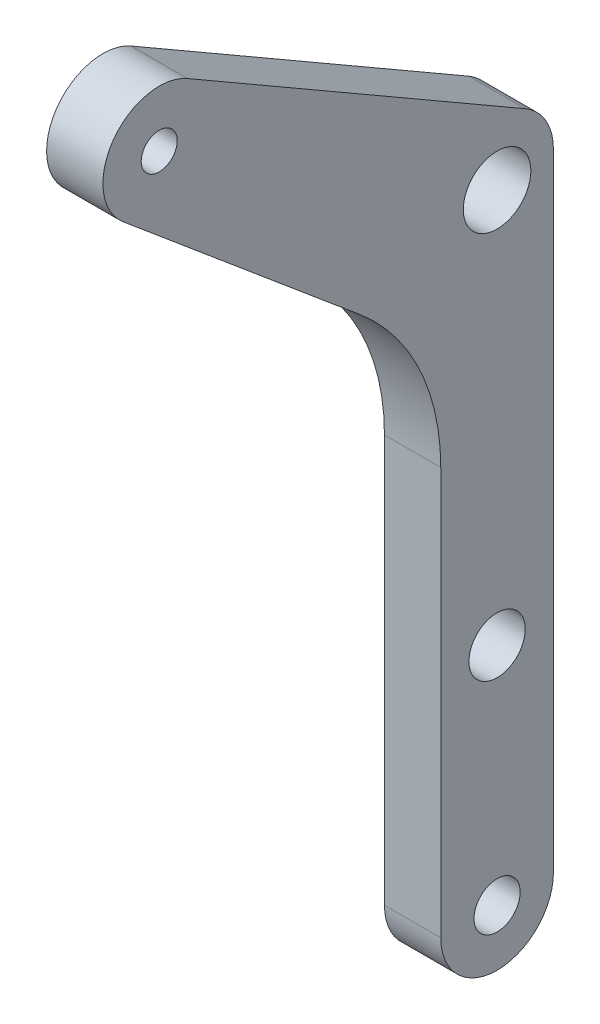
ISO-10303-21;
HEADER;
FILE_DESCRIPTION(('STEP AP214'),'2;1');
FILE_NAME('part.step','',(''),(''),'','','');
FILE_SCHEMA(('AUTOMOTIVE_DESIGN { 1 0 10303 214 1 1 1 1 }'));
ENDSEC;
DATA;
#1=APPLICATION_CONTEXT('core data for automotive mechanical design processes');
#2=APPLICATION_PROTOCOL_DEFINITION('international standard','automotive_design',2000,#1);
#3=PRODUCT_CONTEXT('',#1,'mechanical');
#4=PRODUCT('Part','Part','',(#3));
#5=PRODUCT_RELATED_PRODUCT_CATEGORY('part','',(#4));
#6=PRODUCT_DEFINITION_FORMATION('','',#4);
#7=PRODUCT_DEFINITION_CONTEXT('part definition',#1,'design');
#8=PRODUCT_DEFINITION('design','',#6,#7);
#9=PRODUCT_DEFINITION_SHAPE('','',#8);
#10=(LENGTH_UNIT() NAMED_UNIT(*) SI_UNIT(.MILLI.,.METRE.));
#11=(NAMED_UNIT(*) PLANE_ANGLE_UNIT() SI_UNIT($,.RADIAN.));
#12=(NAMED_UNIT(*) SI_UNIT($,.STERADIAN.) SOLID_ANGLE_UNIT());
#13=UNCERTAINTY_MEASURE_WITH_UNIT(LENGTH_MEASURE(1.E-05),#10,'distance_accuracy_value','');
#14=(GEOMETRIC_REPRESENTATION_CONTEXT(3) GLOBAL_UNCERTAINTY_ASSIGNED_CONTEXT((#13)) GLOBAL_UNIT_ASSIGNED_CONTEXT((#10,
#11,#12)) REPRESENTATION_CONTEXT('',''));
#15=CARTESIAN_POINT('',(0.,0.,0.));
#16=DIRECTION('',(0.,0.,1.));
#17=DIRECTION('',(1.,0.,0.));
#18=AXIS2_PLACEMENT_3D('',#15,#16,#17);
#19=CARTESIAN_POINT('',(5.,73.,30.));
#20=DIRECTION('',(-1.,0.,0.));
#21=DIRECTION('',(0.,0.,1.));
#22=AXIS2_PLACEMENT_3D('',#19,#20,#21);
#23=CYLINDRICAL_SURFACE('',#22,1.6);
#24=CARTESIAN_POINT('',(5.,73.,30.));
#25=DIRECTION('',(1.,0.,0.));
#26=DIRECTION('',(0.,0.,-1.));
#27=AXIS2_PLACEMENT_3D('',#24,#25,#26);
#28=CIRCLE('',#27,1.6);
#29=CARTESIAN_POINT('',(5.,73.,28.4));
#30=VERTEX_POINT('',#29);
#31=EDGE_CURVE('E200',#30,#30,#28,.T.);
#32=ORIENTED_EDGE('',*,*,#31,.T.);
#33=EDGE_LOOP('',(#32));
#34=FACE_BOUND('',#33,.T.);
#35=CARTESIAN_POINT('',(1.5,73.,30.));
#36=DIRECTION('',(-1.,0.,0.));
#37=DIRECTION('',(0.,0.,1.));
#38=AXIS2_PLACEMENT_3D('',#35,#36,#37);
#39=CIRCLE('',#38,1.6);
#40=CARTESIAN_POINT('',(1.5,73.,31.6));
#41=VERTEX_POINT('',#40);
#42=EDGE_CURVE('E40',#41,#41,#39,.T.);
#43=ORIENTED_EDGE('',*,*,#42,.T.);
#44=EDGE_LOOP('',(#43));
#45=FACE_BOUND('',#44,.T.);
#46=ADVANCED_FACE('F36',(#34,#45),#23,.F.);
#47=CARTESIAN_POINT('',(5.,55.679491924311,0.));
#48=DIRECTION('',(1.,0.,0.));
#49=DIRECTION('',(0.,0.,-1.));
#50=AXIS2_PLACEMENT_3D('',#47,#48,#49);
#51=PLANE('',#50);
#52=CARTESIAN_POINT('',(5.,55.,0.));
#53=DIRECTION('',(1.,0.,0.));
#54=DIRECTION('',(0.,0.,-1.));
#55=AXIS2_PLACEMENT_3D('',#52,#53,#54);
#56=CIRCLE('',#55,3.);
#57=CARTESIAN_POINT('',(5.,55.,-3.));
#58=VERTEX_POINT('',#57);
#59=EDGE_CURVE('E194',#58,#58,#56,.T.);
#60=ORIENTED_EDGE('',*,*,#59,.F.);
#61=EDGE_LOOP('',(#60));
#62=FACE_BOUND('',#61,.T.);
#63=CARTESIAN_POINT('',(5.,0.,0.));
#64=DIRECTION('',(1.,0.,0.));
#65=DIRECTION('',(0.,0.,-1.));
#66=AXIS2_PLACEMENT_3D('',#63,#64,#65);
#67=CIRCLE('',#66,2.05);
#68=CARTESIAN_POINT('',(5.,0.,-2.05));
#69=VERTEX_POINT('',#68);
#70=EDGE_CURVE('E139',#69,#69,#67,.T.);
#71=ORIENTED_EDGE('',*,*,#70,.F.);
#72=EDGE_LOOP('',(#71));
#73=FACE_BOUND('',#72,.T.);
#74=CARTESIAN_POINT('',(5.,55.679491924311,0.));
#75=DIRECTION('',(1.,0.,0.));
#76=DIRECTION('',(0.,0.,-1.));
#77=AXIS2_PLACEMENT_3D('',#74,#75,#76);
#78=CIRCLE('',#77,5.);
#79=CARTESIAN_POINT('',(5.,55.679491924311,-5.));
#80=VERTEX_POINT('',#79);
#81=CARTESIAN_POINT('',(5.,60.0096189432332,-2.50000000000002));
#82=VERTEX_POINT('',#81);
#83=EDGE_CURVE('E150',#80,#82,#78,.T.);
#84=ORIENTED_EDGE('',*,*,#83,.T.);
#85=DIRECTION('',(0.,0.500000000000004,0.866025403784436));
#86=VECTOR('',#85,1.);
#87=CARTESIAN_POINT('',(5.,60.0096189432332,-2.50000000000002));
#88=LINE('',#87,#86);
#89=CARTESIAN_POINT('',(5.,77.3301270189222,27.5));
#90=VERTEX_POINT('',#89);
#91=EDGE_CURVE('E97',#82,#90,#88,.T.);
#92=ORIENTED_EDGE('',*,*,#91,.T.);
#93=CARTESIAN_POINT('',(5.,73.,30.));
#94=DIRECTION('',(1.,0.,0.));
#95=DIRECTION('',(0.,0.,-1.));
#96=AXIS2_PLACEMENT_3D('',#93,#94,#95);
#97=CIRCLE('',#96,5.);
#98=CARTESIAN_POINT('',(5.,69.1697777844051,33.2139380484327));
#99=VERTEX_POINT('',#98);
#100=EDGE_CURVE('E166',#90,#99,#97,.T.);
#101=ORIENTED_EDGE('',*,*,#100,.T.);
#102=DIRECTION('',(0.,-0.642787609686544,-0.766044443118974));
#103=VECTOR('',#102,1.);
#104=CARTESIAN_POINT('',(5.,69.1697777844051,33.2139380484327));
#105=LINE('',#104,#103);
#106=CARTESIAN_POINT('',(5.,51.4902084731859,12.1442478062691));
#107=VERTEX_POINT('',#106);
#108=EDGE_CURVE('E179',#99,#107,#105,.T.);
#109=ORIENTED_EDGE('',*,*,#108,.T.);
#110=CARTESIAN_POINT('',(5.,36.1693196108064,25.));
#111=DIRECTION('',(-1.,0.,0.));
#112=DIRECTION('',(0.,0.,1.));
#113=AXIS2_PLACEMENT_3D('',#110,#111,#112);
#114=CIRCLE('',#113,20.);
#115=CARTESIAN_POINT('',(5.,36.1693196108064,5.00000000000001));
#116=VERTEX_POINT('',#115);
#117=EDGE_CURVE('E117',#107,#116,#114,.T.);
#118=ORIENTED_EDGE('',*,*,#117,.T.);
#119=DIRECTION('',(0.,-1.,0.));
#120=VECTOR('',#119,1.);
#121=CARTESIAN_POINT('',(5.,36.1693196108064,5.00000000000001));
#122=LINE('',#121,#120);
#123=CARTESIAN_POINT('',(5.,0.,5.));
#124=VERTEX_POINT('',#123);
#125=EDGE_CURVE('E110',#116,#124,#122,.T.);
#126=ORIENTED_EDGE('',*,*,#125,.T.);
#127=CARTESIAN_POINT('',(5.,0.,0.));
#128=DIRECTION('',(1.,0.,0.));
#129=DIRECTION('',(0.,0.,-1.));
#130=AXIS2_PLACEMENT_3D('',#127,#128,#129);
#131=CIRCLE('',#130,5.);
#132=CARTESIAN_POINT('',(5.,0.,-5.));
#133=VERTEX_POINT('',#132);
#134=EDGE_CURVE('E115',#124,#133,#131,.T.);
#135=ORIENTED_EDGE('',*,*,#134,.T.);
#136=DIRECTION('',(0.,1.,0.));
#137=VECTOR('',#136,1.);
#138=CARTESIAN_POINT('',(5.,0.,-5.));
#139=LINE('',#138,#137);
#140=EDGE_CURVE('E54',#133,#80,#139,.T.);
#141=ORIENTED_EDGE('',*,*,#140,.T.);
#142=EDGE_LOOP('',(#84,#92,#101,#109,#118,#126,#135,#141));
#143=FACE_BOUND('',#142,.T.);
#144=CARTESIAN_POINT('',(5.,20.,0.));
#145=DIRECTION('',(1.,0.,0.));
#146=DIRECTION('',(0.,0.,-1.));
#147=AXIS2_PLACEMENT_3D('',#144,#145,#146);
#148=CIRCLE('',#147,2.5);
#149=CARTESIAN_POINT('',(5.,20.,-2.5));
#150=VERTEX_POINT('',#149);
#151=EDGE_CURVE('E188',#150,#150,#148,.T.);
#152=ORIENTED_EDGE('',*,*,#151,.F.);
#153=EDGE_LOOP('',(#152));
#154=FACE_BOUND('',#153,.T.);
#155=ORIENTED_EDGE('',*,*,#31,.F.);
#156=EDGE_LOOP('',(#155));
#157=FACE_BOUND('',#156,.T.);
#158=ADVANCED_FACE('F112',(#62,#73,#143,#154,#157),#51,.T.);
#159=CARTESIAN_POINT('',(0.,55.679491924311,0.));
#160=DIRECTION('',(1.,0.,0.));
#161=DIRECTION('',(0.,0.,-1.));
#162=AXIS2_PLACEMENT_3D('',#159,#160,#161);
#163=PLANE('',#162);
#164=CARTESIAN_POINT('',(0.,73.,30.));
#165=DIRECTION('',(-1.,0.,0.));
#166=DIRECTION('',(0.,0.,1.));
#167=AXIS2_PLACEMENT_3D('',#164,#165,#166);
#168=CIRCLE('',#167,2.25);
#169=CARTESIAN_POINT('',(0.,73.,32.25));
#170=VERTEX_POINT('',#169);
#171=EDGE_CURVE('E205',#170,#170,#168,.T.);
#172=ORIENTED_EDGE('',*,*,#171,.F.);
#173=EDGE_LOOP('',(#172));
#174=FACE_BOUND('',#173,.T.);
#175=CARTESIAN_POINT('',(0.,55.679491924311,0.));
#176=DIRECTION('',(1.,0.,0.));
#177=DIRECTION('',(0.,0.,-1.));
#178=AXIS2_PLACEMENT_3D('',#175,#176,#177);
#179=CIRCLE('',#178,5.);
#180=CARTESIAN_POINT('',(0.,55.679491924311,-5.));
#181=VERTEX_POINT('',#180);
#182=CARTESIAN_POINT('',(0.,60.0096189432332,-2.50000000000002));
#183=VERTEX_POINT('',#182);
#184=EDGE_CURVE('E135',#181,#183,#179,.T.);
#185=ORIENTED_EDGE('',*,*,#184,.F.);
#186=DIRECTION('',(0.,1.,0.));
#187=VECTOR('',#186,1.);
#188=CARTESIAN_POINT('',(0.,0.,-5.));
#189=LINE('',#188,#187);
#190=CARTESIAN_POINT('',(0.,0.,-5.));
#191=VERTEX_POINT('',#190);
#192=EDGE_CURVE('E89',#191,#181,#189,.T.);
#193=ORIENTED_EDGE('',*,*,#192,.F.);
#194=CARTESIAN_POINT('',(0.,0.,0.));
#195=DIRECTION('',(1.,0.,0.));
#196=DIRECTION('',(0.,0.,-1.));
#197=AXIS2_PLACEMENT_3D('',#194,#195,#196);
#198=CIRCLE('',#197,5.);
#199=CARTESIAN_POINT('',(0.,0.,5.));
#200=VERTEX_POINT('',#199);
#201=EDGE_CURVE('E83',#200,#191,#198,.T.);
#202=ORIENTED_EDGE('',*,*,#201,.F.);
#203=DIRECTION('',(0.,-1.,0.));
#204=VECTOR('',#203,1.);
#205=CARTESIAN_POINT('',(0.,36.1693196108064,5.00000000000001));
#206=LINE('',#205,#204);
#207=CARTESIAN_POINT('',(0.,36.1693196108064,5.00000000000001));
#208=VERTEX_POINT('',#207);
#209=EDGE_CURVE('E125',#208,#200,#206,.T.);
#210=ORIENTED_EDGE('',*,*,#209,.F.);
#211=CARTESIAN_POINT('',(0.,36.1693196108064,25.));
#212=DIRECTION('',(-1.,0.,0.));
#213=DIRECTION('',(0.,0.,1.));
#214=AXIS2_PLACEMENT_3D('',#211,#212,#213);
#215=CIRCLE('',#214,20.);
#216=CARTESIAN_POINT('',(0.,51.4902084731859,12.1442478062691));
#217=VERTEX_POINT('',#216);
#218=EDGE_CURVE('E145',#217,#208,#215,.T.);
#219=ORIENTED_EDGE('',*,*,#218,.F.);
#220=DIRECTION('',(0.,-0.642787609686544,-0.766044443118974));
#221=VECTOR('',#220,1.);
#222=CARTESIAN_POINT('',(0.,69.1697777844051,33.2139380484327));
#223=LINE('',#222,#221);
#224=CARTESIAN_POINT('',(0.,69.1697777844051,33.2139380484327));
#225=VERTEX_POINT('',#224);
#226=EDGE_CURVE('E143',#225,#217,#223,.T.);
#227=ORIENTED_EDGE('',*,*,#226,.F.);
#228=CARTESIAN_POINT('',(0.,73.,30.));
#229=DIRECTION('',(1.,0.,0.));
#230=DIRECTION('',(0.,0.,-1.));
#231=AXIS2_PLACEMENT_3D('',#228,#229,#230);
#232=CIRCLE('',#231,5.);
#233=CARTESIAN_POINT('',(0.,77.3301270189222,27.5));
#234=VERTEX_POINT('',#233);
#235=EDGE_CURVE('E141',#234,#225,#232,.T.);
#236=ORIENTED_EDGE('',*,*,#235,.F.);
#237=DIRECTION('',(0.,0.500000000000004,0.866025403784436));
#238=VECTOR('',#237,1.);
#239=CARTESIAN_POINT('',(0.,60.0096189432332,-2.50000000000002));
#240=LINE('',#239,#238);
#241=EDGE_CURVE('E138',#183,#234,#240,.T.);
#242=ORIENTED_EDGE('',*,*,#241,.F.);
#243=EDGE_LOOP('',(#185,#193,#202,#210,#219,#227,#236,#242));
#244=FACE_BOUND('',#243,.T.);
#245=CARTESIAN_POINT('',(0.,0.,0.));
#246=DIRECTION('',(1.,0.,0.));
#247=DIRECTION('',(0.,0.,-1.));
#248=AXIS2_PLACEMENT_3D('',#245,#246,#247);
#249=CIRCLE('',#248,2.05);
#250=CARTESIAN_POINT('',(0.,0.,-2.05));
#251=VERTEX_POINT('',#250);
#252=EDGE_CURVE('E185',#251,#251,#249,.T.);
#253=ORIENTED_EDGE('',*,*,#252,.T.);
#254=EDGE_LOOP('',(#253));
#255=FACE_BOUND('',#254,.T.);
#256=CARTESIAN_POINT('',(0.,20.,0.));
#257=DIRECTION('',(1.,0.,0.));
#258=DIRECTION('',(0.,0.,-1.));
#259=AXIS2_PLACEMENT_3D('',#256,#257,#258);
#260=CIRCLE('',#259,2.5);
#261=CARTESIAN_POINT('',(0.,20.,-2.5));
#262=VERTEX_POINT('',#261);
#263=EDGE_CURVE('E191',#262,#262,#260,.T.);
#264=ORIENTED_EDGE('',*,*,#263,.T.);
#265=EDGE_LOOP('',(#264));
#266=FACE_BOUND('',#265,.T.);
#267=CARTESIAN_POINT('',(0.,55.,0.));
#268=DIRECTION('',(1.,0.,0.));
#269=DIRECTION('',(0.,0.,-1.));
#270=AXIS2_PLACEMENT_3D('',#267,#268,#269);
#271=CIRCLE('',#270,3.);
#272=CARTESIAN_POINT('',(0.,55.,-3.));
#273=VERTEX_POINT('',#272);
#274=EDGE_CURVE('E197',#273,#273,#271,.T.);
#275=ORIENTED_EDGE('',*,*,#274,.T.);
#276=EDGE_LOOP('',(#275));
#277=FACE_BOUND('',#276,.T.);
#278=ADVANCED_FACE('F170',(#174,#244,#255,#266,#277),#163,.F.);
#279=CARTESIAN_POINT('',(5.,55.679491924311,0.));
#280=DIRECTION('',(-1.,0.,0.));
#281=DIRECTION('',(0.,0.,1.));
#282=AXIS2_PLACEMENT_3D('',#279,#280,#281);
#283=CYLINDRICAL_SURFACE('',#282,5.);
#284=ORIENTED_EDGE('',*,*,#184,.T.);
#285=DIRECTION('',(-1.,0.,0.));
#286=VECTOR('',#285,1.);
#287=CARTESIAN_POINT('',(5.,60.0096189432332,-2.50000000000002));
#288=LINE('',#287,#286);
#289=EDGE_CURVE('E11',#82,#183,#288,.T.);
#290=ORIENTED_EDGE('',*,*,#289,.F.);
#291=ORIENTED_EDGE('',*,*,#83,.F.);
#292=DIRECTION('',(-1.,0.,0.));
#293=VECTOR('',#292,1.);
#294=CARTESIAN_POINT('',(5.,55.679491924311,-5.));
#295=LINE('',#294,#293);
#296=EDGE_CURVE('E131',#80,#181,#295,.T.);
#297=ORIENTED_EDGE('',*,*,#296,.T.);
#298=EDGE_LOOP('',(#284,#290,#291,#297));
#299=FACE_BOUND('',#298,.T.);
#300=ADVANCED_FACE('F38',(#299),#283,.T.);
#301=CARTESIAN_POINT('',(5.,60.0096189432332,-2.50000000000002));
#302=DIRECTION('',(0.,-0.866025403784437,0.500000000000004));
#303=DIRECTION('',(0.,-0.500000000000004,-0.866025403784437));
#304=AXIS2_PLACEMENT_3D('',#301,#302,#303);
#305=PLANE('',#304);
#306=ORIENTED_EDGE('',*,*,#241,.T.);
#307=DIRECTION('',(-1.,0.,0.));
#308=VECTOR('',#307,1.);
#309=CARTESIAN_POINT('',(5.,77.3301270189222,27.5));
#310=LINE('',#309,#308);
#311=EDGE_CURVE('E46',#90,#234,#310,.T.);
#312=ORIENTED_EDGE('',*,*,#311,.F.);
#313=ORIENTED_EDGE('',*,*,#91,.F.);
#314=ORIENTED_EDGE('',*,*,#289,.T.);
#315=EDGE_LOOP('',(#306,#312,#313,#314));
#316=FACE_BOUND('',#315,.T.);
#317=ADVANCED_FACE('F261',(#316),#305,.F.);
#318=CARTESIAN_POINT('',(5.,73.,30.));
#319=DIRECTION('',(-1.,0.,0.));
#320=DIRECTION('',(0.,0.,1.));
#321=AXIS2_PLACEMENT_3D('',#318,#319,#320);
#322=CYLINDRICAL_SURFACE('',#321,5.);
#323=ORIENTED_EDGE('',*,*,#235,.T.);
#324=DIRECTION('',(-1.,0.,0.));
#325=VECTOR('',#324,1.);
#326=CARTESIAN_POINT('',(5.,69.1697777844051,33.2139380484327));
#327=LINE('',#326,#325);
#328=EDGE_CURVE('E157',#99,#225,#327,.T.);
#329=ORIENTED_EDGE('',*,*,#328,.F.);
#330=ORIENTED_EDGE('',*,*,#100,.F.);
#331=ORIENTED_EDGE('',*,*,#311,.T.);
#332=EDGE_LOOP('',(#323,#329,#330,#331));
#333=FACE_BOUND('',#332,.T.);
#334=ADVANCED_FACE('F164',(#333),#322,.T.);
#335=CARTESIAN_POINT('',(5.,69.1697777844051,33.2139380484327));
#336=DIRECTION('',(0.,0.766044443118974,-0.642787609686544));
#337=DIRECTION('',(0.,0.642787609686544,0.766044443118974));
#338=AXIS2_PLACEMENT_3D('',#335,#336,#337);
#339=PLANE('',#338);
#340=ORIENTED_EDGE('',*,*,#226,.T.);
#341=DIRECTION('',(-1.,0.,0.));
#342=VECTOR('',#341,1.);
#343=CARTESIAN_POINT('',(5.,51.4902084731859,12.1442478062691));
#344=LINE('',#343,#342);
#345=EDGE_CURVE('E154',#107,#217,#344,.T.);
#346=ORIENTED_EDGE('',*,*,#345,.F.);
#347=ORIENTED_EDGE('',*,*,#108,.F.);
#348=ORIENTED_EDGE('',*,*,#328,.T.);
#349=EDGE_LOOP('',(#340,#346,#347,#348));
#350=FACE_BOUND('',#349,.T.);
#351=ADVANCED_FACE('F175',(#350),#339,.F.);
#352=CARTESIAN_POINT('',(5.,36.1693196108064,25.));
#353=DIRECTION('',(-1.,0.,0.));
#354=DIRECTION('',(0.,0.,1.));
#355=AXIS2_PLACEMENT_3D('',#352,#353,#354);
#356=CYLINDRICAL_SURFACE('',#355,20.);
#357=ORIENTED_EDGE('',*,*,#218,.T.);
#358=DIRECTION('',(-1.,0.,0.));
#359=VECTOR('',#358,1.);
#360=CARTESIAN_POINT('',(5.,36.1693196108064,5.00000000000001));
#361=LINE('',#360,#359);
#362=EDGE_CURVE('E126',#116,#208,#361,.T.);
#363=ORIENTED_EDGE('',*,*,#362,.F.);
#364=ORIENTED_EDGE('',*,*,#117,.F.);
#365=ORIENTED_EDGE('',*,*,#345,.T.);
#366=EDGE_LOOP('',(#357,#363,#364,#365));
#367=FACE_BOUND('',#366,.T.);
#368=ADVANCED_FACE('F178',(#367),#356,.F.);
#369=CARTESIAN_POINT('',(5.,36.1693196108064,5.00000000000001));
#370=DIRECTION('',(0.,0.,-1.));
#371=DIRECTION('',(0.,1.,0.));
#372=AXIS2_PLACEMENT_3D('',#369,#370,#371);
#373=PLANE('',#372);
#374=ORIENTED_EDGE('',*,*,#209,.T.);
#375=DIRECTION('',(-1.,0.,0.));
#376=VECTOR('',#375,1.);
#377=CARTESIAN_POINT('',(5.,0.,5.));
#378=LINE('',#377,#376);
#379=EDGE_CURVE('E122',#124,#200,#378,.T.);
#380=ORIENTED_EDGE('',*,*,#379,.F.);
#381=ORIENTED_EDGE('',*,*,#125,.F.);
#382=ORIENTED_EDGE('',*,*,#362,.T.);
#383=EDGE_LOOP('',(#374,#380,#381,#382));
#384=FACE_BOUND('',#383,.T.);
#385=ADVANCED_FACE('F123',(#384),#373,.F.);
#386=CARTESIAN_POINT('',(5.,0.,0.));
#387=DIRECTION('',(-1.,0.,0.));
#388=DIRECTION('',(0.,0.,1.));
#389=AXIS2_PLACEMENT_3D('',#386,#387,#388);
#390=CYLINDRICAL_SURFACE('',#389,5.);
#391=ORIENTED_EDGE('',*,*,#201,.T.);
#392=DIRECTION('',(-1.,0.,0.));
#393=VECTOR('',#392,1.);
#394=CARTESIAN_POINT('',(5.,0.,-5.));
#395=LINE('',#394,#393);
#396=EDGE_CURVE('E127',#133,#191,#395,.T.);
#397=ORIENTED_EDGE('',*,*,#396,.F.);
#398=ORIENTED_EDGE('',*,*,#134,.F.);
#399=ORIENTED_EDGE('',*,*,#379,.T.);
#400=EDGE_LOOP('',(#391,#397,#398,#399));
#401=FACE_BOUND('',#400,.T.);
#402=ADVANCED_FACE('F129',(#401),#390,.T.);
#403=CARTESIAN_POINT('',(5.,0.,-5.));
#404=DIRECTION('',(0.,0.,1.));
#405=DIRECTION('',(1.,0.,0.));
#406=AXIS2_PLACEMENT_3D('',#403,#404,#405);
#407=PLANE('',#406);
#408=ORIENTED_EDGE('',*,*,#192,.T.);
#409=ORIENTED_EDGE('',*,*,#296,.F.);
#410=ORIENTED_EDGE('',*,*,#140,.F.);
#411=ORIENTED_EDGE('',*,*,#396,.T.);
#412=EDGE_LOOP('',(#408,#409,#410,#411));
#413=FACE_BOUND('',#412,.T.);
#414=ADVANCED_FACE('F244',(#413),#407,.F.);
#415=CARTESIAN_POINT('',(5.,0.,0.));
#416=DIRECTION('',(-1.,0.,0.));
#417=DIRECTION('',(0.,0.,1.));
#418=AXIS2_PLACEMENT_3D('',#415,#416,#417);
#419=CYLINDRICAL_SURFACE('',#418,2.05);
#420=ORIENTED_EDGE('',*,*,#70,.T.);
#421=EDGE_LOOP('',(#420));
#422=FACE_BOUND('',#421,.T.);
#423=ORIENTED_EDGE('',*,*,#252,.F.);
#424=EDGE_LOOP('',(#423));
#425=FACE_BOUND('',#424,.T.);
#426=ADVANCED_FACE('F241',(#422,#425),#419,.F.);
#427=CARTESIAN_POINT('',(5.,20.,0.));
#428=DIRECTION('',(-1.,0.,0.));
#429=DIRECTION('',(0.,0.,1.));
#430=AXIS2_PLACEMENT_3D('',#427,#428,#429);
#431=CYLINDRICAL_SURFACE('',#430,2.5);
#432=ORIENTED_EDGE('',*,*,#151,.T.);
#433=EDGE_LOOP('',(#432));
#434=FACE_BOUND('',#433,.T.);
#435=ORIENTED_EDGE('',*,*,#263,.F.);
#436=EDGE_LOOP('',(#435));
#437=FACE_BOUND('',#436,.T.);
#438=ADVANCED_FACE('F237',(#434,#437),#431,.F.);
#439=CARTESIAN_POINT('',(5.,55.,0.));
#440=DIRECTION('',(-1.,0.,0.));
#441=DIRECTION('',(0.,0.,1.));
#442=AXIS2_PLACEMENT_3D('',#439,#440,#441);
#443=CYLINDRICAL_SURFACE('',#442,3.);
#444=ORIENTED_EDGE('',*,*,#59,.T.);
#445=EDGE_LOOP('',(#444));
#446=FACE_BOUND('',#445,.T.);
#447=ORIENTED_EDGE('',*,*,#274,.F.);
#448=EDGE_LOOP('',(#447));
#449=FACE_BOUND('',#448,.T.);
#450=ADVANCED_FACE('F223',(#446,#449),#443,.F.);
#451=CARTESIAN_POINT('',(1.5,73.,30.));
#452=DIRECTION('',(-1.,0.,0.));
#453=DIRECTION('',(0.,0.,1.));
#454=AXIS2_PLACEMENT_3D('',#451,#452,#453);
#455=CYLINDRICAL_SURFACE('',#454,2.25);
#456=CARTESIAN_POINT('',(1.5,73.,30.));
#457=DIRECTION('',(-1.,0.,0.));
#458=DIRECTION('',(0.,0.,1.));
#459=AXIS2_PLACEMENT_3D('',#456,#457,#458);
#460=CIRCLE('',#459,2.25);
#461=CARTESIAN_POINT('',(1.5,73.,32.25));
#462=VERTEX_POINT('',#461);
#463=EDGE_CURVE('E208',#462,#462,#460,.T.);
#464=ORIENTED_EDGE('',*,*,#463,.F.);
#465=EDGE_LOOP('',(#464));
#466=FACE_BOUND('',#465,.T.);
#467=ORIENTED_EDGE('',*,*,#171,.T.);
#468=EDGE_LOOP('',(#467));
#469=FACE_BOUND('',#468,.T.);
#470=ADVANCED_FACE('F218',(#466,#469),#455,.F.);
#471=CARTESIAN_POINT('',(1.5,73.,30.));
#472=DIRECTION('',(-1.,0.,0.));
#473=DIRECTION('',(0.,0.,1.));
#474=AXIS2_PLACEMENT_3D('',#471,#472,#473);
#475=PLANE('',#474);
#476=ORIENTED_EDGE('',*,*,#42,.F.);
#477=EDGE_LOOP('',(#476));
#478=FACE_BOUND('',#477,.T.);
#479=ORIENTED_EDGE('',*,*,#463,.T.);
#480=EDGE_LOOP('',(#479));
#481=FACE_BOUND('',#480,.T.);
#482=ADVANCED_FACE('F216',(#478,#481),#475,.T.);
#483=CLOSED_SHELL('',(#46,#158,#278,#300,#317,#334,#351,#368,#385,#402,#414,#426,#438,#450,#470,#482));
#484=MANIFOLD_SOLID_BREP('B2',#483);
#485=ADVANCED_BREP_SHAPE_REPRESENTATION('',(#18,#484),#14);
#486=SHAPE_DEFINITION_REPRESENTATION(#9,#485);
ENDSEC;
END-ISO-10303-21;
